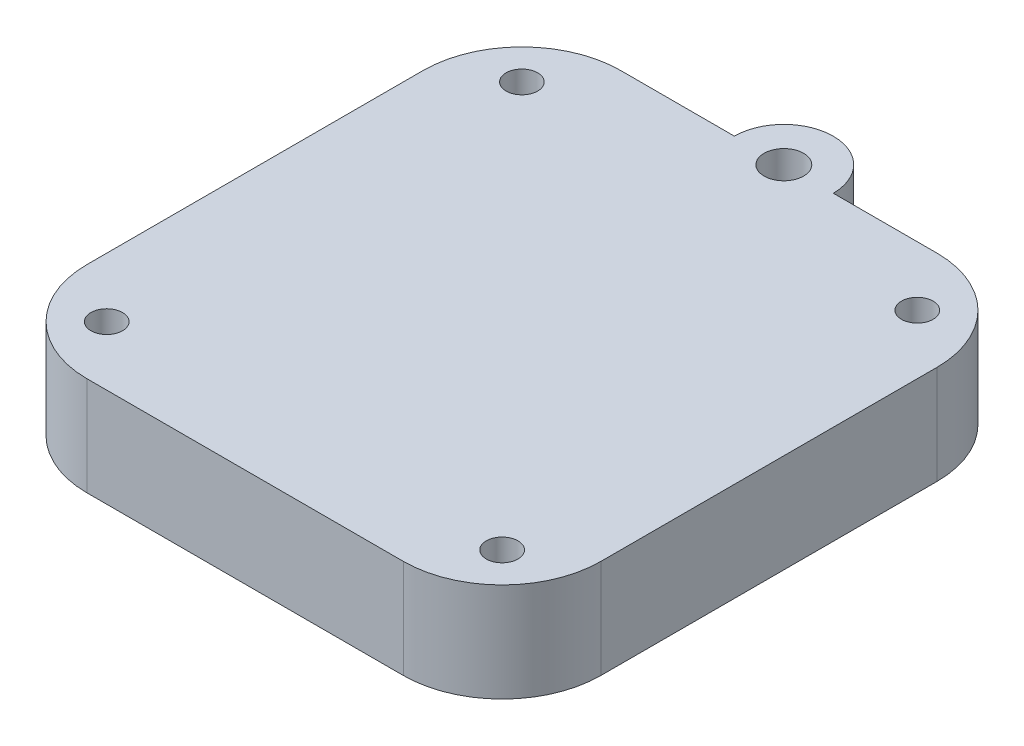
ISO-10303-21;
HEADER;
FILE_DESCRIPTION(('STEP AP214'),'2;1');
FILE_NAME('part.step','',(''),(''),'','','');
FILE_SCHEMA(('AUTOMOTIVE_DESIGN { 1 0 10303 214 1 1 1 1 }'));
ENDSEC;
DATA;
#1=APPLICATION_CONTEXT('core data for automotive mechanical design processes');
#2=APPLICATION_PROTOCOL_DEFINITION('international standard','automotive_design',2000,#1);
#3=PRODUCT_CONTEXT('',#1,'mechanical');
#4=PRODUCT('Part','Part','',(#3));
#5=PRODUCT_RELATED_PRODUCT_CATEGORY('part','',(#4));
#6=PRODUCT_DEFINITION_FORMATION('','',#4);
#7=PRODUCT_DEFINITION_CONTEXT('part definition',#1,'design');
#8=PRODUCT_DEFINITION('design','',#6,#7);
#9=PRODUCT_DEFINITION_SHAPE('','',#8);
#10=(LENGTH_UNIT() NAMED_UNIT(*) SI_UNIT(.MILLI.,.METRE.));
#11=(NAMED_UNIT(*) PLANE_ANGLE_UNIT() SI_UNIT($,.RADIAN.));
#12=(NAMED_UNIT(*) SI_UNIT($,.STERADIAN.) SOLID_ANGLE_UNIT());
#13=UNCERTAINTY_MEASURE_WITH_UNIT(LENGTH_MEASURE(1.E-05),#10,'distance_accuracy_value','');
#14=(GEOMETRIC_REPRESENTATION_CONTEXT(3) GLOBAL_UNCERTAINTY_ASSIGNED_CONTEXT((#13)) GLOBAL_UNIT_ASSIGNED_CONTEXT((#10,
#11,#12)) REPRESENTATION_CONTEXT('',''));
#15=CARTESIAN_POINT('',(0.,0.,0.));
#16=DIRECTION('',(0.,0.,1.));
#17=DIRECTION('',(1.,0.,0.));
#18=AXIS2_PLACEMENT_3D('',#15,#16,#17);
#19=CARTESIAN_POINT('',(16.,10.,17.));
#20=DIRECTION('',(0.,-1.,0.));
#21=DIRECTION('',(0.,0.,-1.));
#22=AXIS2_PLACEMENT_3D('',#19,#20,#21);
#23=CYLINDRICAL_SURFACE('',#22,10.);
#24=DIRECTION('',(0.,-1.,0.));
#25=VECTOR('',#24,1.);
#26=CARTESIAN_POINT('',(26.,10.,17.));
#27=LINE('',#26,#25);
#28=CARTESIAN_POINT('',(26.,10.,17.));
#29=VERTEX_POINT('',#28);
#30=CARTESIAN_POINT('',(26.,0.,17.));
#31=VERTEX_POINT('',#30);
#32=EDGE_CURVE('E185',#29,#31,#27,.T.);
#33=ORIENTED_EDGE('',*,*,#32,.F.);
#34=CARTESIAN_POINT('',(16.,10.,17.));
#35=DIRECTION('',(0.,1.,0.));
#36=DIRECTION('',(0.,0.,1.));
#37=AXIS2_PLACEMENT_3D('',#34,#35,#36);
#38=CIRCLE('',#37,10.);
#39=CARTESIAN_POINT('',(16.,10.,27.));
#40=VERTEX_POINT('',#39);
#41=EDGE_CURVE('E40',#40,#29,#38,.T.);
#42=ORIENTED_EDGE('',*,*,#41,.F.);
#43=DIRECTION('',(0.,-1.,0.));
#44=VECTOR('',#43,1.);
#45=CARTESIAN_POINT('',(16.,10.,27.));
#46=LINE('',#45,#44);
#47=CARTESIAN_POINT('',(16.,0.,27.));
#48=VERTEX_POINT('',#47);
#49=EDGE_CURVE('E188',#48,#40,#46,.F.);
#50=ORIENTED_EDGE('',*,*,#49,.F.);
#51=CARTESIAN_POINT('',(16.,0.,17.));
#52=DIRECTION('',(0.,1.,0.));
#53=DIRECTION('',(0.,0.,1.));
#54=AXIS2_PLACEMENT_3D('',#51,#52,#53);
#55=CIRCLE('',#54,10.);
#56=EDGE_CURVE('E11',#31,#48,#55,.F.);
#57=ORIENTED_EDGE('',*,*,#56,.F.);
#58=EDGE_LOOP('',(#33,#42,#50,#57));
#59=FACE_BOUND('',#58,.T.);
#60=ADVANCED_FACE('F33',(#59),#23,.T.);
#61=CARTESIAN_POINT('',(-16.,10.,17.));
#62=DIRECTION('',(0.,1.,0.));
#63=DIRECTION('',(0.,0.,1.));
#64=AXIS2_PLACEMENT_3D('',#61,#62,#63);
#65=CYLINDRICAL_SURFACE('',#64,10.);
#66=DIRECTION('',(0.,1.,0.));
#67=VECTOR('',#66,1.);
#68=CARTESIAN_POINT('',(-26.,10.,17.));
#69=LINE('',#68,#67);
#70=CARTESIAN_POINT('',(-26.,0.,17.));
#71=VERTEX_POINT('',#70);
#72=CARTESIAN_POINT('',(-26.,10.,17.));
#73=VERTEX_POINT('',#72);
#74=EDGE_CURVE('E175',#71,#73,#69,.T.);
#75=ORIENTED_EDGE('',*,*,#74,.F.);
#76=CARTESIAN_POINT('',(-16.,0.,17.));
#77=DIRECTION('',(0.,1.,0.));
#78=DIRECTION('',(0.,0.,1.));
#79=AXIS2_PLACEMENT_3D('',#76,#77,#78);
#80=CIRCLE('',#79,10.);
#81=CARTESIAN_POINT('',(-16.,0.,27.));
#82=VERTEX_POINT('',#81);
#83=EDGE_CURVE('E181',#82,#71,#80,.F.);
#84=ORIENTED_EDGE('',*,*,#83,.F.);
#85=DIRECTION('',(0.,1.,0.));
#86=VECTOR('',#85,1.);
#87=CARTESIAN_POINT('',(-16.,10.,27.));
#88=LINE('',#87,#86);
#89=CARTESIAN_POINT('',(-16.,10.,27.));
#90=VERTEX_POINT('',#89);
#91=EDGE_CURVE('E178',#90,#82,#88,.F.);
#92=ORIENTED_EDGE('',*,*,#91,.F.);
#93=CARTESIAN_POINT('',(-16.,10.,17.));
#94=DIRECTION('',(0.,1.,0.));
#95=DIRECTION('',(0.,0.,1.));
#96=AXIS2_PLACEMENT_3D('',#93,#94,#95);
#97=CIRCLE('',#96,10.);
#98=EDGE_CURVE('E183',#73,#90,#97,.T.);
#99=ORIENTED_EDGE('',*,*,#98,.F.);
#100=EDGE_LOOP('',(#75,#84,#92,#99));
#101=FACE_BOUND('',#100,.T.);
#102=ADVANCED_FACE('F250',(#101),#65,.T.);
#103=CARTESIAN_POINT('',(16.,10.,-17.));
#104=DIRECTION('',(0.,-1.,0.));
#105=DIRECTION('',(0.,0.,-1.));
#106=AXIS2_PLACEMENT_3D('',#103,#104,#105);
#107=CYLINDRICAL_SURFACE('',#106,10.);
#108=DIRECTION('',(0.,-1.,0.));
#109=VECTOR('',#108,1.);
#110=CARTESIAN_POINT('',(16.,10.,-27.));
#111=LINE('',#110,#109);
#112=CARTESIAN_POINT('',(16.,10.,-27.));
#113=VERTEX_POINT('',#112);
#114=CARTESIAN_POINT('',(16.,0.,-27.));
#115=VERTEX_POINT('',#114);
#116=EDGE_CURVE('E166',#113,#115,#111,.T.);
#117=ORIENTED_EDGE('',*,*,#116,.F.);
#118=CARTESIAN_POINT('',(16.,10.,-17.));
#119=DIRECTION('',(0.,1.,0.));
#120=DIRECTION('',(0.,0.,1.));
#121=AXIS2_PLACEMENT_3D('',#118,#119,#120);
#122=CIRCLE('',#121,10.);
#123=CARTESIAN_POINT('',(26.,10.,-17.));
#124=VERTEX_POINT('',#123);
#125=EDGE_CURVE('E116',#124,#113,#122,.T.);
#126=ORIENTED_EDGE('',*,*,#125,.F.);
#127=DIRECTION('',(0.,-1.,0.));
#128=VECTOR('',#127,1.);
#129=CARTESIAN_POINT('',(26.,10.,-17.));
#130=LINE('',#129,#128);
#131=CARTESIAN_POINT('',(26.,0.,-17.));
#132=VERTEX_POINT('',#131);
#133=EDGE_CURVE('E168',#132,#124,#130,.F.);
#134=ORIENTED_EDGE('',*,*,#133,.F.);
#135=CARTESIAN_POINT('',(16.,0.,-17.));
#136=DIRECTION('',(0.,1.,0.));
#137=DIRECTION('',(0.,0.,1.));
#138=AXIS2_PLACEMENT_3D('',#135,#136,#137);
#139=CIRCLE('',#138,10.);
#140=EDGE_CURVE('E172',#115,#132,#139,.F.);
#141=ORIENTED_EDGE('',*,*,#140,.F.);
#142=EDGE_LOOP('',(#117,#126,#134,#141));
#143=FACE_BOUND('',#142,.T.);
#144=ADVANCED_FACE('F243',(#143),#107,.T.);
#145=CARTESIAN_POINT('',(-16.,10.,-17.));
#146=DIRECTION('',(0.,-1.,0.));
#147=DIRECTION('',(0.,0.,-1.));
#148=AXIS2_PLACEMENT_3D('',#145,#146,#147);
#149=CYLINDRICAL_SURFACE('',#148,10.);
#150=DIRECTION('',(0.,-1.,0.));
#151=VECTOR('',#150,1.);
#152=CARTESIAN_POINT('',(-26.,10.,-17.));
#153=LINE('',#152,#151);
#154=CARTESIAN_POINT('',(-26.,10.,-17.));
#155=VERTEX_POINT('',#154);
#156=CARTESIAN_POINT('',(-26.,0.,-17.));
#157=VERTEX_POINT('',#156);
#158=EDGE_CURVE('E129',#155,#157,#153,.T.);
#159=ORIENTED_EDGE('',*,*,#158,.F.);
#160=CARTESIAN_POINT('',(-16.,10.,-17.));
#161=DIRECTION('',(0.,1.,0.));
#162=DIRECTION('',(0.,0.,1.));
#163=AXIS2_PLACEMENT_3D('',#160,#161,#162);
#164=CIRCLE('',#163,10.);
#165=CARTESIAN_POINT('',(-16.,10.,-27.));
#166=VERTEX_POINT('',#165);
#167=EDGE_CURVE('E162',#166,#155,#164,.T.);
#168=ORIENTED_EDGE('',*,*,#167,.F.);
#169=DIRECTION('',(0.,-1.,0.));
#170=VECTOR('',#169,1.);
#171=CARTESIAN_POINT('',(-16.,10.,-27.));
#172=LINE('',#171,#170);
#173=CARTESIAN_POINT('',(-16.,0.,-27.));
#174=VERTEX_POINT('',#173);
#175=EDGE_CURVE('E159',#174,#166,#172,.F.);
#176=ORIENTED_EDGE('',*,*,#175,.F.);
#177=CARTESIAN_POINT('',(-16.,0.,-17.));
#178=DIRECTION('',(0.,1.,0.));
#179=DIRECTION('',(0.,0.,1.));
#180=AXIS2_PLACEMENT_3D('',#177,#178,#179);
#181=CIRCLE('',#180,10.);
#182=EDGE_CURVE('E164',#157,#174,#181,.F.);
#183=ORIENTED_EDGE('',*,*,#182,.F.);
#184=EDGE_LOOP('',(#159,#168,#176,#183));
#185=FACE_BOUND('',#184,.T.);
#186=ADVANCED_FACE('F234',(#185),#149,.T.);
#187=CARTESIAN_POINT('',(0.5,10.,-27.));
#188=DIRECTION('',(0.,1.,0.));
#189=DIRECTION('',(0.,0.,1.));
#190=AXIS2_PLACEMENT_3D('',#187,#188,#189);
#191=PLANE('',#190);
#192=CARTESIAN_POINT('',(20.,10.,21.));
#193=DIRECTION('',(0.,1.,0.));
#194=DIRECTION('',(0.,0.,1.));
#195=AXIS2_PLACEMENT_3D('',#192,#193,#194);
#196=CIRCLE('',#195,1.6);
#197=CARTESIAN_POINT('',(20.,10.,22.6));
#198=VERTEX_POINT('',#197);
#199=EDGE_CURVE('E214',#198,#198,#196,.T.);
#200=ORIENTED_EDGE('',*,*,#199,.F.);
#201=EDGE_LOOP('',(#200));
#202=FACE_BOUND('',#201,.T.);
#203=CARTESIAN_POINT('',(20.,10.,-21.));
#204=DIRECTION('',(0.,1.,0.));
#205=DIRECTION('',(0.,0.,1.));
#206=AXIS2_PLACEMENT_3D('',#203,#204,#205);
#207=CIRCLE('',#206,1.6);
#208=CARTESIAN_POINT('',(20.,10.,-19.4));
#209=VERTEX_POINT('',#208);
#210=EDGE_CURVE('E202',#209,#209,#207,.T.);
#211=ORIENTED_EDGE('',*,*,#210,.F.);
#212=EDGE_LOOP('',(#211));
#213=FACE_BOUND('',#212,.T.);
#214=DIRECTION('',(1.,0.,0.));
#215=VECTOR('',#214,1.);
#216=CARTESIAN_POINT('',(26.,10.,27.));
#217=LINE('',#216,#215);
#218=EDGE_CURVE('E191',#90,#40,#217,.T.);
#219=ORIENTED_EDGE('',*,*,#218,.T.);
#220=ORIENTED_EDGE('',*,*,#41,.T.);
#221=DIRECTION('',(0.,0.,-1.));
#222=VECTOR('',#221,1.);
#223=CARTESIAN_POINT('',(26.,10.,-27.));
#224=LINE('',#223,#222);
#225=EDGE_CURVE('E120',#29,#124,#224,.T.);
#226=ORIENTED_EDGE('',*,*,#225,.T.);
#227=ORIENTED_EDGE('',*,*,#125,.T.);
#228=DIRECTION('',(-1.,0.,0.));
#229=VECTOR('',#228,1.);
#230=CARTESIAN_POINT('',(26.,10.,-27.));
#231=LINE('',#230,#229);
#232=CARTESIAN_POINT('',(5.5,10.,-27.));
#233=VERTEX_POINT('',#232);
#234=EDGE_CURVE('E106',#113,#233,#231,.T.);
#235=ORIENTED_EDGE('',*,*,#234,.T.);
#236=CARTESIAN_POINT('',(0.5,10.,-27.));
#237=DIRECTION('',(0.,1.,0.));
#238=DIRECTION('',(0.,0.,1.));
#239=AXIS2_PLACEMENT_3D('',#236,#237,#238);
#240=CIRCLE('',#239,5.);
#241=CARTESIAN_POINT('',(-4.5,10.,-27.));
#242=VERTEX_POINT('',#241);
#243=EDGE_CURVE('E113',#233,#242,#240,.T.);
#244=ORIENTED_EDGE('',*,*,#243,.T.);
#245=DIRECTION('',(-1.,0.,0.));
#246=VECTOR('',#245,1.);
#247=CARTESIAN_POINT('',(-4.5,10.,-27.));
#248=LINE('',#247,#246);
#249=EDGE_CURVE('E135',#242,#166,#248,.T.);
#250=ORIENTED_EDGE('',*,*,#249,.T.);
#251=ORIENTED_EDGE('',*,*,#167,.T.);
#252=DIRECTION('',(0.,0.,1.));
#253=VECTOR('',#252,1.);
#254=CARTESIAN_POINT('',(-26.,10.,-27.));
#255=LINE('',#254,#253);
#256=EDGE_CURVE('E155',#155,#73,#255,.T.);
#257=ORIENTED_EDGE('',*,*,#256,.T.);
#258=ORIENTED_EDGE('',*,*,#98,.T.);
#259=EDGE_LOOP('',(#219,#220,#226,#227,#235,#244,#250,#251,#257,#258));
#260=FACE_BOUND('',#259,.T.);
#261=CARTESIAN_POINT('',(-20.,10.,-21.));
#262=DIRECTION('',(0.,1.,0.));
#263=DIRECTION('',(0.,0.,1.));
#264=AXIS2_PLACEMENT_3D('',#261,#262,#263);
#265=CIRCLE('',#264,1.6);
#266=CARTESIAN_POINT('',(-20.,10.,-19.4));
#267=VERTEX_POINT('',#266);
#268=EDGE_CURVE('E144',#267,#267,#265,.T.);
#269=ORIENTED_EDGE('',*,*,#268,.F.);
#270=EDGE_LOOP('',(#269));
#271=FACE_BOUND('',#270,.T.);
#272=CARTESIAN_POINT('',(-20.,10.,21.));
#273=DIRECTION('',(0.,1.,0.));
#274=DIRECTION('',(0.,0.,1.));
#275=AXIS2_PLACEMENT_3D('',#272,#273,#274);
#276=CIRCLE('',#275,1.6);
#277=CARTESIAN_POINT('',(-20.,10.,22.6));
#278=VERTEX_POINT('',#277);
#279=EDGE_CURVE('E208',#278,#278,#276,.T.);
#280=ORIENTED_EDGE('',*,*,#279,.F.);
#281=EDGE_LOOP('',(#280));
#282=FACE_BOUND('',#281,.T.);
#283=CARTESIAN_POINT('',(0.5,10.,-27.));
#284=DIRECTION('',(0.,1.,0.));
#285=DIRECTION('',(0.,0.,1.));
#286=AXIS2_PLACEMENT_3D('',#283,#284,#285);
#287=CIRCLE('',#286,2.);
#288=CARTESIAN_POINT('',(0.5,10.,-25.));
#289=VERTEX_POINT('',#288);
#290=EDGE_CURVE('E220',#289,#289,#287,.T.);
#291=ORIENTED_EDGE('',*,*,#290,.F.);
#292=EDGE_LOOP('',(#291));
#293=FACE_BOUND('',#292,.T.);
#294=ADVANCED_FACE('F109',(#202,#213,#260,#271,#282,#293),#191,.T.);
#295=CARTESIAN_POINT('',(0.5,0.,-27.));
#296=DIRECTION('',(0.,1.,0.));
#297=DIRECTION('',(0.,0.,1.));
#298=AXIS2_PLACEMENT_3D('',#295,#296,#297);
#299=PLANE('',#298);
#300=DIRECTION('',(0.,0.,-1.));
#301=VECTOR('',#300,1.);
#302=CARTESIAN_POINT('',(26.,0.,-27.));
#303=LINE('',#302,#301);
#304=EDGE_CURVE('E147',#31,#132,#303,.T.);
#305=ORIENTED_EDGE('',*,*,#304,.F.);
#306=ORIENTED_EDGE('',*,*,#56,.T.);
#307=DIRECTION('',(1.,0.,0.));
#308=VECTOR('',#307,1.);
#309=CARTESIAN_POINT('',(26.,0.,27.));
#310=LINE('',#309,#308);
#311=EDGE_CURVE('E143',#82,#48,#310,.T.);
#312=ORIENTED_EDGE('',*,*,#311,.F.);
#313=ORIENTED_EDGE('',*,*,#83,.T.);
#314=DIRECTION('',(0.,0.,1.));
#315=VECTOR('',#314,1.);
#316=CARTESIAN_POINT('',(-26.,0.,-27.));
#317=LINE('',#316,#315);
#318=EDGE_CURVE('E140',#157,#71,#317,.T.);
#319=ORIENTED_EDGE('',*,*,#318,.F.);
#320=ORIENTED_EDGE('',*,*,#182,.T.);
#321=DIRECTION('',(-1.,0.,0.));
#322=VECTOR('',#321,1.);
#323=CARTESIAN_POINT('',(-4.5,0.,-27.));
#324=LINE('',#323,#322);
#325=CARTESIAN_POINT('',(-4.5,0.,-27.));
#326=VERTEX_POINT('',#325);
#327=EDGE_CURVE('E152',#326,#174,#324,.T.);
#328=ORIENTED_EDGE('',*,*,#327,.F.);
#329=CARTESIAN_POINT('',(0.5,0.,-27.));
#330=DIRECTION('',(0.,1.,0.));
#331=DIRECTION('',(0.,0.,1.));
#332=AXIS2_PLACEMENT_3D('',#329,#330,#331);
#333=CIRCLE('',#332,5.);
#334=CARTESIAN_POINT('',(5.5,0.,-27.));
#335=VERTEX_POINT('',#334);
#336=EDGE_CURVE('E150',#335,#326,#333,.T.);
#337=ORIENTED_EDGE('',*,*,#336,.F.);
#338=DIRECTION('',(-1.,0.,0.));
#339=VECTOR('',#338,1.);
#340=CARTESIAN_POINT('',(26.,0.,-27.));
#341=LINE('',#340,#339);
#342=EDGE_CURVE('E126',#115,#335,#341,.T.);
#343=ORIENTED_EDGE('',*,*,#342,.F.);
#344=ORIENTED_EDGE('',*,*,#140,.T.);
#345=EDGE_LOOP('',(#305,#306,#312,#313,#319,#320,#328,#337,#343,#344));
#346=FACE_BOUND('',#345,.T.);
#347=CARTESIAN_POINT('',(-20.,0.,-21.));
#348=DIRECTION('',(0.,1.,0.));
#349=DIRECTION('',(0.,0.,1.));
#350=AXIS2_PLACEMENT_3D('',#347,#348,#349);
#351=CIRCLE('',#350,1.6);
#352=CARTESIAN_POINT('',(-20.,0.,-19.4));
#353=VERTEX_POINT('',#352);
#354=EDGE_CURVE('E199',#353,#353,#351,.T.);
#355=ORIENTED_EDGE('',*,*,#354,.T.);
#356=EDGE_LOOP('',(#355));
#357=FACE_BOUND('',#356,.T.);
#358=CARTESIAN_POINT('',(20.,0.,-21.));
#359=DIRECTION('',(0.,1.,0.));
#360=DIRECTION('',(0.,0.,1.));
#361=AXIS2_PLACEMENT_3D('',#358,#359,#360);
#362=CIRCLE('',#361,1.6);
#363=CARTESIAN_POINT('',(20.,0.,-19.4));
#364=VERTEX_POINT('',#363);
#365=EDGE_CURVE('E205',#364,#364,#362,.T.);
#366=ORIENTED_EDGE('',*,*,#365,.T.);
#367=EDGE_LOOP('',(#366));
#368=FACE_BOUND('',#367,.T.);
#369=CARTESIAN_POINT('',(-20.,0.,21.));
#370=DIRECTION('',(0.,1.,0.));
#371=DIRECTION('',(0.,0.,1.));
#372=AXIS2_PLACEMENT_3D('',#369,#370,#371);
#373=CIRCLE('',#372,1.6);
#374=CARTESIAN_POINT('',(-20.,0.,22.6));
#375=VERTEX_POINT('',#374);
#376=EDGE_CURVE('E211',#375,#375,#373,.T.);
#377=ORIENTED_EDGE('',*,*,#376,.T.);
#378=EDGE_LOOP('',(#377));
#379=FACE_BOUND('',#378,.T.);
#380=CARTESIAN_POINT('',(20.,0.,21.));
#381=DIRECTION('',(0.,1.,0.));
#382=DIRECTION('',(0.,0.,1.));
#383=AXIS2_PLACEMENT_3D('',#380,#381,#382);
#384=CIRCLE('',#383,1.6);
#385=CARTESIAN_POINT('',(20.,0.,22.6));
#386=VERTEX_POINT('',#385);
#387=EDGE_CURVE('E217',#386,#386,#384,.T.);
#388=ORIENTED_EDGE('',*,*,#387,.T.);
#389=EDGE_LOOP('',(#388));
#390=FACE_BOUND('',#389,.T.);
#391=CARTESIAN_POINT('',(0.5,0.,-27.));
#392=DIRECTION('',(0.,1.,0.));
#393=DIRECTION('',(0.,0.,1.));
#394=AXIS2_PLACEMENT_3D('',#391,#392,#393);
#395=CIRCLE('',#394,2.);
#396=CARTESIAN_POINT('',(0.5,0.,-25.));
#397=VERTEX_POINT('',#396);
#398=EDGE_CURVE('E223',#397,#397,#395,.T.);
#399=ORIENTED_EDGE('',*,*,#398,.T.);
#400=EDGE_LOOP('',(#399));
#401=FACE_BOUND('',#400,.T.);
#402=ADVANCED_FACE('F233',(#346,#357,#368,#379,#390,#401),#299,.F.);
#403=CARTESIAN_POINT('',(-26.,10.,-27.));
#404=DIRECTION('',(1.,0.,0.));
#405=DIRECTION('',(0.,0.,-1.));
#406=AXIS2_PLACEMENT_3D('',#403,#404,#405);
#407=PLANE('',#406);
#408=ORIENTED_EDGE('',*,*,#318,.T.);
#409=ORIENTED_EDGE('',*,*,#74,.T.);
#410=ORIENTED_EDGE('',*,*,#256,.F.);
#411=ORIENTED_EDGE('',*,*,#158,.T.);
#412=EDGE_LOOP('',(#408,#409,#410,#411));
#413=FACE_BOUND('',#412,.T.);
#414=ADVANCED_FACE('F241',(#413),#407,.F.);
#415=CARTESIAN_POINT('',(26.,10.,27.));
#416=DIRECTION('',(0.,0.,-1.));
#417=DIRECTION('',(-1.,0.,0.));
#418=AXIS2_PLACEMENT_3D('',#415,#416,#417);
#419=PLANE('',#418);
#420=ORIENTED_EDGE('',*,*,#311,.T.);
#421=ORIENTED_EDGE('',*,*,#49,.T.);
#422=ORIENTED_EDGE('',*,*,#218,.F.);
#423=ORIENTED_EDGE('',*,*,#91,.T.);
#424=EDGE_LOOP('',(#420,#421,#422,#423));
#425=FACE_BOUND('',#424,.T.);
#426=ADVANCED_FACE('F264',(#425),#419,.F.);
#427=CARTESIAN_POINT('',(26.,10.,-27.));
#428=DIRECTION('',(-1.,0.,0.));
#429=DIRECTION('',(0.,0.,1.));
#430=AXIS2_PLACEMENT_3D('',#427,#428,#429);
#431=PLANE('',#430);
#432=ORIENTED_EDGE('',*,*,#225,.F.);
#433=ORIENTED_EDGE('',*,*,#32,.T.);
#434=ORIENTED_EDGE('',*,*,#304,.T.);
#435=ORIENTED_EDGE('',*,*,#133,.T.);
#436=EDGE_LOOP('',(#432,#433,#434,#435));
#437=FACE_BOUND('',#436,.T.);
#438=ADVANCED_FACE('F193',(#437),#431,.F.);
#439=CARTESIAN_POINT('',(26.,10.,-27.));
#440=DIRECTION('',(0.,0.,1.));
#441=DIRECTION('',(1.,0.,0.));
#442=AXIS2_PLACEMENT_3D('',#439,#440,#441);
#443=PLANE('',#442);
#444=ORIENTED_EDGE('',*,*,#234,.F.);
#445=ORIENTED_EDGE('',*,*,#116,.T.);
#446=ORIENTED_EDGE('',*,*,#342,.T.);
#447=DIRECTION('',(0.,-1.,0.));
#448=VECTOR('',#447,1.);
#449=CARTESIAN_POINT('',(5.5,10.,-27.));
#450=LINE('',#449,#448);
#451=EDGE_CURVE('E123',#233,#335,#450,.T.);
#452=ORIENTED_EDGE('',*,*,#451,.F.);
#453=EDGE_LOOP('',(#444,#445,#446,#452));
#454=FACE_BOUND('',#453,.T.);
#455=ADVANCED_FACE('F124',(#454),#443,.F.);
#456=CARTESIAN_POINT('',(0.5,10.,-27.));
#457=DIRECTION('',(0.,-1.,0.));
#458=DIRECTION('',(0.,0.,-1.));
#459=AXIS2_PLACEMENT_3D('',#456,#457,#458);
#460=CYLINDRICAL_SURFACE('',#459,5.);
#461=ORIENTED_EDGE('',*,*,#336,.T.);
#462=DIRECTION('',(0.,-1.,0.));
#463=VECTOR('',#462,1.);
#464=CARTESIAN_POINT('',(-4.5,10.,-27.));
#465=LINE('',#464,#463);
#466=EDGE_CURVE('E130',#242,#326,#465,.T.);
#467=ORIENTED_EDGE('',*,*,#466,.F.);
#468=ORIENTED_EDGE('',*,*,#243,.F.);
#469=ORIENTED_EDGE('',*,*,#451,.T.);
#470=EDGE_LOOP('',(#461,#467,#468,#469));
#471=FACE_BOUND('',#470,.T.);
#472=ADVANCED_FACE('F132',(#471),#460,.T.);
#473=CARTESIAN_POINT('',(-4.5,10.,-27.));
#474=DIRECTION('',(0.,0.,1.));
#475=DIRECTION('',(1.,0.,0.));
#476=AXIS2_PLACEMENT_3D('',#473,#474,#475);
#477=PLANE('',#476);
#478=ORIENTED_EDGE('',*,*,#327,.T.);
#479=ORIENTED_EDGE('',*,*,#175,.T.);
#480=ORIENTED_EDGE('',*,*,#249,.F.);
#481=ORIENTED_EDGE('',*,*,#466,.T.);
#482=EDGE_LOOP('',(#478,#479,#480,#481));
#483=FACE_BOUND('',#482,.T.);
#484=ADVANCED_FACE('F275',(#483),#477,.F.);
#485=CARTESIAN_POINT('',(-20.,10.,-21.));
#486=DIRECTION('',(0.,-1.,0.));
#487=DIRECTION('',(0.,0.,-1.));
#488=AXIS2_PLACEMENT_3D('',#485,#486,#487);
#489=CYLINDRICAL_SURFACE('',#488,1.6);
#490=ORIENTED_EDGE('',*,*,#268,.T.);
#491=EDGE_LOOP('',(#490));
#492=FACE_BOUND('',#491,.T.);
#493=ORIENTED_EDGE('',*,*,#354,.F.);
#494=EDGE_LOOP('',(#493));
#495=FACE_BOUND('',#494,.T.);
#496=ADVANCED_FACE('F277',(#492,#495),#489,.F.);
#497=CARTESIAN_POINT('',(20.,10.,-21.));
#498=DIRECTION('',(0.,-1.,0.));
#499=DIRECTION('',(0.,0.,-1.));
#500=AXIS2_PLACEMENT_3D('',#497,#498,#499);
#501=CYLINDRICAL_SURFACE('',#500,1.6);
#502=ORIENTED_EDGE('',*,*,#210,.T.);
#503=EDGE_LOOP('',(#502));
#504=FACE_BOUND('',#503,.T.);
#505=ORIENTED_EDGE('',*,*,#365,.F.);
#506=EDGE_LOOP('',(#505));
#507=FACE_BOUND('',#506,.T.);
#508=ADVANCED_FACE('F282',(#504,#507),#501,.F.);
#509=CARTESIAN_POINT('',(-20.,10.,21.));
#510=DIRECTION('',(0.,-1.,0.));
#511=DIRECTION('',(0.,0.,-1.));
#512=AXIS2_PLACEMENT_3D('',#509,#510,#511);
#513=CYLINDRICAL_SURFACE('',#512,1.6);
#514=ORIENTED_EDGE('',*,*,#279,.T.);
#515=EDGE_LOOP('',(#514));
#516=FACE_BOUND('',#515,.T.);
#517=ORIENTED_EDGE('',*,*,#376,.F.);
#518=EDGE_LOOP('',(#517));
#519=FACE_BOUND('',#518,.T.);
#520=ADVANCED_FACE('F306',(#516,#519),#513,.F.);
#521=CARTESIAN_POINT('',(20.,10.,21.));
#522=DIRECTION('',(0.,-1.,0.));
#523=DIRECTION('',(0.,0.,-1.));
#524=AXIS2_PLACEMENT_3D('',#521,#522,#523);
#525=CYLINDRICAL_SURFACE('',#524,1.6);
#526=ORIENTED_EDGE('',*,*,#199,.T.);
#527=EDGE_LOOP('',(#526));
#528=FACE_BOUND('',#527,.T.);
#529=ORIENTED_EDGE('',*,*,#387,.F.);
#530=EDGE_LOOP('',(#529));
#531=FACE_BOUND('',#530,.T.);
#532=ADVANCED_FACE('F301',(#528,#531),#525,.F.);
#533=CARTESIAN_POINT('',(0.5,10.,-27.));
#534=DIRECTION('',(0.,-1.,0.));
#535=DIRECTION('',(0.,0.,-1.));
#536=AXIS2_PLACEMENT_3D('',#533,#534,#535);
#537=CYLINDRICAL_SURFACE('',#536,2.);
#538=ORIENTED_EDGE('',*,*,#290,.T.);
#539=EDGE_LOOP('',(#538));
#540=FACE_BOUND('',#539,.T.);
#541=ORIENTED_EDGE('',*,*,#398,.F.);
#542=EDGE_LOOP('',(#541));
#543=FACE_BOUND('',#542,.T.);
#544=ADVANCED_FACE('F229',(#540,#543),#537,.F.);
#545=CLOSED_SHELL('',(#60,#102,#144,#186,#294,#402,#414,#426,#438,#455,#472,#484,#496,#508,#520,
#532,#544));
#546=MANIFOLD_SOLID_BREP('B2',#545);
#547=ADVANCED_BREP_SHAPE_REPRESENTATION('',(#18,#546),#14);
#548=SHAPE_DEFINITION_REPRESENTATION(#9,#547);
ENDSEC;
END-ISO-10303-21;
